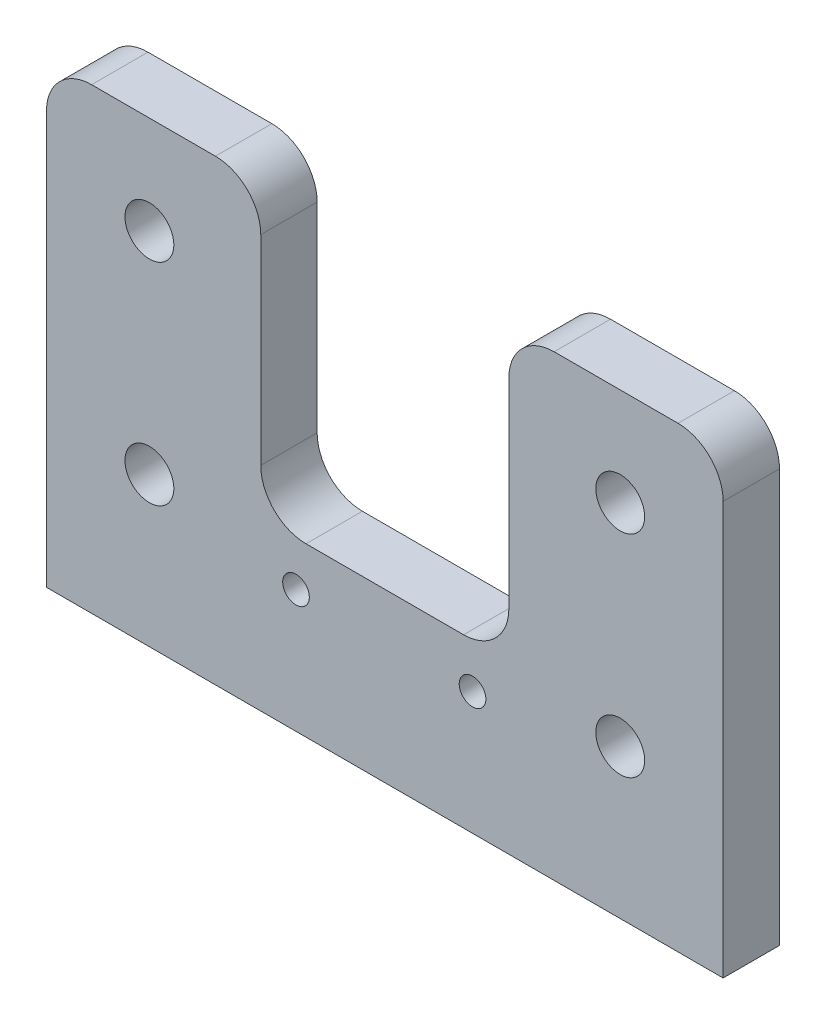
ISO-10303-21;
HEADER;
FILE_DESCRIPTION(('STEP AP214'),'2;1');
FILE_NAME('part.step','',(''),(''),'','','');
FILE_SCHEMA(('AUTOMOTIVE_DESIGN { 1 0 10303 214 1 1 1 1 }'));
ENDSEC;
DATA;
#1=APPLICATION_CONTEXT('core data for automotive mechanical design processes');
#2=APPLICATION_PROTOCOL_DEFINITION('international standard','automotive_design',2000,#1);
#3=PRODUCT_CONTEXT('',#1,'mechanical');
#4=PRODUCT('Part','Part','',(#3));
#5=PRODUCT_RELATED_PRODUCT_CATEGORY('part','',(#4));
#6=PRODUCT_DEFINITION_FORMATION('','',#4);
#7=PRODUCT_DEFINITION_CONTEXT('part definition',#1,'design');
#8=PRODUCT_DEFINITION('design','',#6,#7);
#9=PRODUCT_DEFINITION_SHAPE('','',#8);
#10=(LENGTH_UNIT() NAMED_UNIT(*) SI_UNIT(.MILLI.,.METRE.));
#11=(NAMED_UNIT(*) PLANE_ANGLE_UNIT() SI_UNIT($,.RADIAN.));
#12=(NAMED_UNIT(*) SI_UNIT($,.STERADIAN.) SOLID_ANGLE_UNIT());
#13=UNCERTAINTY_MEASURE_WITH_UNIT(LENGTH_MEASURE(1.E-05),#10,'distance_accuracy_value','');
#14=(GEOMETRIC_REPRESENTATION_CONTEXT(3) GLOBAL_UNCERTAINTY_ASSIGNED_CONTEXT((#13)) GLOBAL_UNIT_ASSIGNED_CONTEXT((#10,
#11,#12)) REPRESENTATION_CONTEXT('',''));
#15=CARTESIAN_POINT('',(0.,0.,0.));
#16=DIRECTION('',(0.,0.,1.));
#17=DIRECTION('',(1.,0.,0.));
#18=AXIS2_PLACEMENT_3D('',#15,#16,#17);
#19=CARTESIAN_POINT('',(0.,51.562,6.35));
#20=DIRECTION('',(0.,-1.,0.));
#21=DIRECTION('',(0.,0.,-1.));
#22=AXIS2_PLACEMENT_3D('',#19,#20,#21);
#23=PLANE('',#22);
#24=DIRECTION('',(-1.,0.,0.));
#25=VECTOR('',#24,1.);
#26=CARTESIAN_POINT('',(0.,51.562,6.35));
#27=LINE('',#26,#25);
#28=CARTESIAN_POINT('',(19.03,51.562,6.35));
#29=VERTEX_POINT('',#28);
#30=CARTESIAN_POINT('',(5.07999999999997,51.562,6.35));
#31=VERTEX_POINT('',#30);
#32=EDGE_CURVE('E324',#29,#31,#27,.T.);
#33=ORIENTED_EDGE('',*,*,#32,.F.);
#34=DIRECTION('',(0.,0.,1.));
#35=VECTOR('',#34,1.);
#36=CARTESIAN_POINT('',(19.03,51.562,0.));
#37=LINE('',#36,#35);
#38=CARTESIAN_POINT('',(19.03,51.562,0.));
#39=VERTEX_POINT('',#38);
#40=EDGE_CURVE('E239',#29,#39,#37,.F.);
#41=ORIENTED_EDGE('',*,*,#40,.T.);
#42=DIRECTION('',(-1.,0.,0.));
#43=VECTOR('',#42,1.);
#44=CARTESIAN_POINT('',(0.,51.562,0.));
#45=LINE('',#44,#43);
#46=CARTESIAN_POINT('',(5.07999999999997,51.562,0.));
#47=VERTEX_POINT('',#46);
#48=EDGE_CURVE('E336',#39,#47,#45,.T.);
#49=ORIENTED_EDGE('',*,*,#48,.T.);
#50=DIRECTION('',(0.,0.,-1.));
#51=VECTOR('',#50,1.);
#52=CARTESIAN_POINT('',(5.07999999999997,51.562,6.35));
#53=LINE('',#52,#51);
#54=EDGE_CURVE('E207',#47,#31,#53,.F.);
#55=ORIENTED_EDGE('',*,*,#54,.T.);
#56=EDGE_LOOP('',(#33,#41,#49,#55));
#57=FACE_BOUND('',#56,.T.);
#58=ADVANCED_FACE('F38',(#57),#23,.F.);
#59=CARTESIAN_POINT('',(0.,0.,6.35));
#60=DIRECTION('',(1.,0.,0.));
#61=DIRECTION('',(0.,1.,0.));
#62=AXIS2_PLACEMENT_3D('',#59,#60,#61);
#63=PLANE('',#62);
#64=DIRECTION('',(0.,-1.,0.));
#65=VECTOR('',#64,1.);
#66=CARTESIAN_POINT('',(0.,0.,6.35));
#67=LINE('',#66,#65);
#68=CARTESIAN_POINT('',(0.,46.482,6.35));
#69=VERTEX_POINT('',#68);
#70=CARTESIAN_POINT('',(0.,0.,6.35));
#71=VERTEX_POINT('',#70);
#72=EDGE_CURVE('E141',#69,#71,#67,.T.);
#73=ORIENTED_EDGE('',*,*,#72,.F.);
#74=DIRECTION('',(0.,0.,-1.));
#75=VECTOR('',#74,1.);
#76=CARTESIAN_POINT('',(0.,46.482,6.35));
#77=LINE('',#76,#75);
#78=CARTESIAN_POINT('',(0.,46.482,0.));
#79=VERTEX_POINT('',#78);
#80=EDGE_CURVE('E204',#69,#79,#77,.T.);
#81=ORIENTED_EDGE('',*,*,#80,.T.);
#82=DIRECTION('',(0.,-1.,0.));
#83=VECTOR('',#82,1.);
#84=CARTESIAN_POINT('',(0.,0.,0.));
#85=LINE('',#84,#83);
#86=CARTESIAN_POINT('',(0.,0.,0.));
#87=VERTEX_POINT('',#86);
#88=EDGE_CURVE('E169',#79,#87,#85,.T.);
#89=ORIENTED_EDGE('',*,*,#88,.T.);
#90=DIRECTION('',(0.,0.,-1.));
#91=VECTOR('',#90,1.);
#92=CARTESIAN_POINT('',(0.,0.,6.35));
#93=LINE('',#92,#91);
#94=EDGE_CURVE('E160',#71,#87,#93,.T.);
#95=ORIENTED_EDGE('',*,*,#94,.F.);
#96=EDGE_LOOP('',(#73,#81,#89,#95));
#97=FACE_BOUND('',#96,.T.);
#98=ADVANCED_FACE('F167',(#97),#63,.F.);
#99=CARTESIAN_POINT('',(0.,0.,6.35));
#100=DIRECTION('',(0.,1.,0.));
#101=DIRECTION('',(0.,0.,1.));
#102=AXIS2_PLACEMENT_3D('',#99,#100,#101);
#103=PLANE('',#102);
#104=DIRECTION('',(1.,0.,0.));
#105=VECTOR('',#104,1.);
#106=CARTESIAN_POINT('',(0.,0.,0.));
#107=LINE('',#106,#105);
#108=CARTESIAN_POINT('',(76.2,0.,0.));
#109=VERTEX_POINT('',#108);
#110=EDGE_CURVE('E330',#87,#109,#107,.T.);
#111=ORIENTED_EDGE('',*,*,#110,.T.);
#112=DIRECTION('',(0.,0.,-1.));
#113=VECTOR('',#112,1.);
#114=CARTESIAN_POINT('',(76.2,0.,6.35));
#115=LINE('',#114,#113);
#116=CARTESIAN_POINT('',(76.2,0.,6.35));
#117=VERTEX_POINT('',#116);
#118=EDGE_CURVE('E162',#117,#109,#115,.T.);
#119=ORIENTED_EDGE('',*,*,#118,.F.);
#120=DIRECTION('',(1.,0.,0.));
#121=VECTOR('',#120,1.);
#122=CARTESIAN_POINT('',(0.,0.,6.35));
#123=LINE('',#122,#121);
#124=EDGE_CURVE('E146',#71,#117,#123,.T.);
#125=ORIENTED_EDGE('',*,*,#124,.F.);
#126=ORIENTED_EDGE('',*,*,#94,.T.);
#127=EDGE_LOOP('',(#111,#119,#125,#126));
#128=FACE_BOUND('',#127,.T.);
#129=ADVANCED_FACE('F159',(#128),#103,.F.);
#130=CARTESIAN_POINT('',(76.2,0.,6.35));
#131=DIRECTION('',(-1.,0.,0.));
#132=DIRECTION('',(0.,-1.,0.));
#133=AXIS2_PLACEMENT_3D('',#130,#131,#132);
#134=PLANE('',#133);
#135=DIRECTION('',(0.,1.,0.));
#136=VECTOR('',#135,1.);
#137=CARTESIAN_POINT('',(76.2,0.,0.));
#138=LINE('',#137,#136);
#139=CARTESIAN_POINT('',(76.2,46.482,0.));
#140=VERTEX_POINT('',#139);
#141=EDGE_CURVE('E333',#109,#140,#138,.T.);
#142=ORIENTED_EDGE('',*,*,#141,.T.);
#143=DIRECTION('',(0.,0.,-1.));
#144=VECTOR('',#143,1.);
#145=CARTESIAN_POINT('',(76.2,46.482,6.35));
#146=LINE('',#145,#144);
#147=CARTESIAN_POINT('',(76.2,46.482,6.35));
#148=VERTEX_POINT('',#147);
#149=EDGE_CURVE('E196',#140,#148,#146,.F.);
#150=ORIENTED_EDGE('',*,*,#149,.T.);
#151=DIRECTION('',(0.,1.,0.));
#152=VECTOR('',#151,1.);
#153=CARTESIAN_POINT('',(76.2,0.,6.35));
#154=LINE('',#153,#152);
#155=EDGE_CURVE('E165',#117,#148,#154,.T.);
#156=ORIENTED_EDGE('',*,*,#155,.F.);
#157=ORIENTED_EDGE('',*,*,#118,.T.);
#158=EDGE_LOOP('',(#142,#150,#156,#157));
#159=FACE_BOUND('',#158,.T.);
#160=ADVANCED_FACE('F376',(#159),#134,.F.);
#161=CARTESIAN_POINT('',(71.12,51.562,0.));
#162=VERTEX_POINT('',#161);
#163=CARTESIAN_POINT('',(57.17,51.562,0.));
#164=VERTEX_POINT('',#163);
#165=EDGE_CURVE('E155',#162,#164,#45,.T.);
#166=ORIENTED_EDGE('',*,*,#165,.T.);
#167=DIRECTION('',(0.,0.,1.));
#168=VECTOR('',#167,1.);
#169=CARTESIAN_POINT('',(57.17,51.562,6.35));
#170=LINE('',#169,#168);
#171=CARTESIAN_POINT('',(57.17,51.562,6.35));
#172=VERTEX_POINT('',#171);
#173=EDGE_CURVE('E254',#164,#172,#170,.T.);
#174=ORIENTED_EDGE('',*,*,#173,.T.);
#175=CARTESIAN_POINT('',(71.12,51.562,6.35));
#176=VERTEX_POINT('',#175);
#177=EDGE_CURVE('E179',#176,#172,#27,.T.);
#178=ORIENTED_EDGE('',*,*,#177,.F.);
#179=DIRECTION('',(0.,0.,-1.));
#180=VECTOR('',#179,1.);
#181=CARTESIAN_POINT('',(71.12,51.562,6.35));
#182=LINE('',#181,#180);
#183=EDGE_CURVE('E185',#176,#162,#182,.T.);
#184=ORIENTED_EDGE('',*,*,#183,.T.);
#185=EDGE_LOOP('',(#166,#174,#178,#184));
#186=FACE_BOUND('',#185,.T.);
#187=ADVANCED_FACE('F368',(#186),#23,.F.);
#188=CARTESIAN_POINT('',(0.,0.,6.35));
#189=DIRECTION('',(0.,0.,-1.));
#190=DIRECTION('',(-1.,0.,0.));
#191=AXIS2_PLACEMENT_3D('',#188,#189,#190);
#192=PLANE('',#191);
#193=CARTESIAN_POINT('',(47.98,13.83,6.35));
#194=DIRECTION('',(0.,0.,1.));
#195=DIRECTION('',(1.,0.,0.));
#196=AXIS2_PLACEMENT_3D('',#193,#194,#195);
#197=CIRCLE('',#196,1.5);
#198=CARTESIAN_POINT('',(49.48,13.83,6.35));
#199=VERTEX_POINT('',#198);
#200=EDGE_CURVE('E275',#199,#199,#197,.T.);
#201=ORIENTED_EDGE('',*,*,#200,.F.);
#202=EDGE_LOOP('',(#201));
#203=FACE_BOUND('',#202,.T.);
#204=CARTESIAN_POINT('',(28.1,13.83,6.35));
#205=DIRECTION('',(0.,0.,1.));
#206=DIRECTION('',(1.,0.,0.));
#207=AXIS2_PLACEMENT_3D('',#204,#205,#206);
#208=CIRCLE('',#207,1.5);
#209=CARTESIAN_POINT('',(29.6,13.83,6.35));
#210=VERTEX_POINT('',#209);
#211=EDGE_CURVE('E283',#210,#210,#208,.T.);
#212=ORIENTED_EDGE('',*,*,#211,.F.);
#213=EDGE_LOOP('',(#212));
#214=FACE_BOUND('',#213,.T.);
#215=CARTESIAN_POINT('',(11.588,40.562,6.35));
#216=DIRECTION('',(0.,0.,-1.));
#217=DIRECTION('',(-1.,0.,0.));
#218=AXIS2_PLACEMENT_3D('',#215,#216,#217);
#219=CIRCLE('',#218,2.75000000000001);
#220=CARTESIAN_POINT('',(8.83799999999995,40.562,6.35));
#221=VERTEX_POINT('',#220);
#222=EDGE_CURVE('E222',#221,#221,#219,.T.);
#223=ORIENTED_EDGE('',*,*,#222,.T.);
#224=EDGE_LOOP('',(#223));
#225=FACE_BOUND('',#224,.T.);
#226=CARTESIAN_POINT('',(64.612,40.562,6.35));
#227=DIRECTION('',(0.,0.,1.));
#228=DIRECTION('',(1.,0.,0.));
#229=AXIS2_PLACEMENT_3D('',#226,#227,#228);
#230=CIRCLE('',#229,2.75000000000001);
#231=CARTESIAN_POINT('',(67.362,40.562,6.35));
#232=VERTEX_POINT('',#231);
#233=EDGE_CURVE('E217',#232,#232,#230,.T.);
#234=ORIENTED_EDGE('',*,*,#233,.F.);
#235=EDGE_LOOP('',(#234));
#236=FACE_BOUND('',#235,.T.);
#237=CARTESIAN_POINT('',(11.588,16.8,6.34999999999999));
#238=DIRECTION('',(0.,0.,-1.));
#239=DIRECTION('',(-1.,0.,0.));
#240=AXIS2_PLACEMENT_3D('',#237,#238,#239);
#241=CIRCLE('',#240,2.75);
#242=CARTESIAN_POINT('',(8.83799999999999,16.8,6.34999999999999));
#243=VERTEX_POINT('',#242);
#244=EDGE_CURVE('E311',#243,#243,#241,.T.);
#245=ORIENTED_EDGE('',*,*,#244,.T.);
#246=EDGE_LOOP('',(#245));
#247=FACE_BOUND('',#246,.T.);
#248=CARTESIAN_POINT('',(64.612,16.8,6.34999999999999));
#249=DIRECTION('',(0.,0.,-1.));
#250=DIRECTION('',(-1.,0.,0.));
#251=AXIS2_PLACEMENT_3D('',#248,#249,#250);
#252=CIRCLE('',#251,2.75);
#253=CARTESIAN_POINT('',(61.862,16.8,6.34999999999999));
#254=VERTEX_POINT('',#253);
#255=EDGE_CURVE('E304',#254,#254,#252,.T.);
#256=ORIENTED_EDGE('',*,*,#255,.T.);
#257=EDGE_LOOP('',(#256));
#258=FACE_BOUND('',#257,.T.);
#259=DIRECTION('',(0.,1.,0.));
#260=VECTOR('',#259,1.);
#261=CARTESIAN_POINT('',(24.13,38.862,6.35));
#262=LINE('',#261,#260);
#263=CARTESIAN_POINT('',(24.13,23.962,6.35));
#264=VERTEX_POINT('',#263);
#265=CARTESIAN_POINT('',(24.13,46.462,6.35));
#266=VERTEX_POINT('',#265);
#267=EDGE_CURVE('E319',#264,#266,#262,.T.);
#268=ORIENTED_EDGE('',*,*,#267,.T.);
#269=CARTESIAN_POINT('',(19.03,46.462,6.35));
#270=DIRECTION('',(0.,0.,-1.));
#271=DIRECTION('',(-1.,0.,0.));
#272=AXIS2_PLACEMENT_3D('',#269,#270,#271);
#273=CIRCLE('',#272,5.1);
#274=EDGE_CURVE('E236',#266,#29,#273,.F.);
#275=ORIENTED_EDGE('',*,*,#274,.T.);
#276=ORIENTED_EDGE('',*,*,#32,.T.);
#277=CARTESIAN_POINT('',(5.07999999999997,46.482,6.35));
#278=DIRECTION('',(0.,0.,-1.));
#279=DIRECTION('',(-1.,0.,0.));
#280=AXIS2_PLACEMENT_3D('',#277,#278,#279);
#281=CIRCLE('',#280,5.08);
#282=EDGE_CURVE('E149',#31,#69,#281,.F.);
#283=ORIENTED_EDGE('',*,*,#282,.T.);
#284=ORIENTED_EDGE('',*,*,#72,.T.);
#285=ORIENTED_EDGE('',*,*,#124,.T.);
#286=ORIENTED_EDGE('',*,*,#155,.T.);
#287=CARTESIAN_POINT('',(71.12,46.482,6.35));
#288=DIRECTION('',(0.,0.,-1.));
#289=DIRECTION('',(-1.,0.,0.));
#290=AXIS2_PLACEMENT_3D('',#287,#288,#289);
#291=CIRCLE('',#290,5.08);
#292=EDGE_CURVE('E201',#148,#176,#291,.F.);
#293=ORIENTED_EDGE('',*,*,#292,.T.);
#294=ORIENTED_EDGE('',*,*,#177,.T.);
#295=CARTESIAN_POINT('',(57.17,46.462,6.35));
#296=DIRECTION('',(0.,0.,-1.));
#297=DIRECTION('',(-1.,0.,0.));
#298=AXIS2_PLACEMENT_3D('',#295,#296,#297);
#299=CIRCLE('',#298,5.1);
#300=CARTESIAN_POINT('',(52.07,46.462,6.35));
#301=VERTEX_POINT('',#300);
#302=EDGE_CURVE('E233',#172,#301,#299,.F.);
#303=ORIENTED_EDGE('',*,*,#302,.T.);
#304=DIRECTION('',(0.,1.,0.));
#305=VECTOR('',#304,1.);
#306=CARTESIAN_POINT('',(52.07,38.862,6.35));
#307=LINE('',#306,#305);
#308=CARTESIAN_POINT('',(52.07,23.962,6.35));
#309=VERTEX_POINT('',#308);
#310=EDGE_CURVE('E315',#309,#301,#307,.T.);
#311=ORIENTED_EDGE('',*,*,#310,.F.);
#312=CARTESIAN_POINT('',(46.97,23.962,6.35));
#313=DIRECTION('',(0.,0.,-1.));
#314=DIRECTION('',(-1.,0.,0.));
#315=AXIS2_PLACEMENT_3D('',#312,#313,#314);
#316=CIRCLE('',#315,5.1);
#317=CARTESIAN_POINT('',(46.97,18.862,6.35));
#318=VERTEX_POINT('',#317);
#319=EDGE_CURVE('E48',#309,#318,#316,.T.);
#320=ORIENTED_EDGE('',*,*,#319,.T.);
#321=DIRECTION('',(1.,0.,0.));
#322=VECTOR('',#321,1.);
#323=CARTESIAN_POINT('',(52.07,18.862,6.35));
#324=LINE('',#323,#322);
#325=CARTESIAN_POINT('',(29.23,18.862,6.35));
#326=VERTEX_POINT('',#325);
#327=EDGE_CURVE('E281',#326,#318,#324,.T.);
#328=ORIENTED_EDGE('',*,*,#327,.F.);
#329=CARTESIAN_POINT('',(29.23,23.962,6.35));
#330=DIRECTION('',(0.,0.,-1.));
#331=DIRECTION('',(-1.,0.,0.));
#332=AXIS2_PLACEMENT_3D('',#329,#330,#331);
#333=CIRCLE('',#332,5.1);
#334=EDGE_CURVE('E265',#326,#264,#333,.T.);
#335=ORIENTED_EDGE('',*,*,#334,.T.);
#336=EDGE_LOOP('',(#268,#275,#276,#283,#284,#285,#286,#293,#294,#303,#311,#320,#328,#335));
#337=FACE_BOUND('',#336,.T.);
#338=ADVANCED_FACE('F144',(#203,#214,#225,#236,#247,#258,#337),#192,.F.);
#339=CARTESIAN_POINT('',(0.,0.,0.));
#340=DIRECTION('',(0.,0.,-1.));
#341=DIRECTION('',(-1.,0.,0.));
#342=AXIS2_PLACEMENT_3D('',#339,#340,#341);
#343=PLANE('',#342);
#344=CARTESIAN_POINT('',(47.98,13.83,0.));
#345=DIRECTION('',(0.,0.,-1.));
#346=DIRECTION('',(-1.,0.,0.));
#347=AXIS2_PLACEMENT_3D('',#344,#345,#346);
#348=CIRCLE('',#347,1.5);
#349=CARTESIAN_POINT('',(46.48,13.83,0.));
#350=VERTEX_POINT('',#349);
#351=EDGE_CURVE('E42',#350,#350,#348,.T.);
#352=ORIENTED_EDGE('',*,*,#351,.F.);
#353=EDGE_LOOP('',(#352));
#354=FACE_BOUND('',#353,.T.);
#355=CARTESIAN_POINT('',(28.1,13.83,0.));
#356=DIRECTION('',(0.,0.,-1.));
#357=DIRECTION('',(-1.,0.,0.));
#358=AXIS2_PLACEMENT_3D('',#355,#356,#357);
#359=CIRCLE('',#358,1.5);
#360=CARTESIAN_POINT('',(26.6,13.83,0.));
#361=VERTEX_POINT('',#360);
#362=EDGE_CURVE('E272',#361,#361,#359,.T.);
#363=ORIENTED_EDGE('',*,*,#362,.F.);
#364=EDGE_LOOP('',(#363));
#365=FACE_BOUND('',#364,.T.);
#366=ORIENTED_EDGE('',*,*,#48,.F.);
#367=CARTESIAN_POINT('',(19.03,46.462,0.));
#368=DIRECTION('',(0.,0.,-1.));
#369=DIRECTION('',(-1.,0.,0.));
#370=AXIS2_PLACEMENT_3D('',#367,#368,#369);
#371=CIRCLE('',#370,5.1);
#372=CARTESIAN_POINT('',(24.13,46.462,0.));
#373=VERTEX_POINT('',#372);
#374=EDGE_CURVE('E244',#39,#373,#371,.T.);
#375=ORIENTED_EDGE('',*,*,#374,.T.);
#376=DIRECTION('',(0.,-1.,0.));
#377=VECTOR('',#376,1.);
#378=CARTESIAN_POINT('',(24.13,0.,0.));
#379=LINE('',#378,#377);
#380=CARTESIAN_POINT('',(24.13,23.962,0.));
#381=VERTEX_POINT('',#380);
#382=EDGE_CURVE('E172',#373,#381,#379,.T.);
#383=ORIENTED_EDGE('',*,*,#382,.T.);
#384=CARTESIAN_POINT('',(29.23,23.962,0.));
#385=DIRECTION('',(0.,0.,-1.));
#386=DIRECTION('',(-1.,0.,0.));
#387=AXIS2_PLACEMENT_3D('',#384,#385,#386);
#388=CIRCLE('',#387,5.1);
#389=CARTESIAN_POINT('',(29.23,18.862,0.));
#390=VERTEX_POINT('',#389);
#391=EDGE_CURVE('E268',#381,#390,#388,.F.);
#392=ORIENTED_EDGE('',*,*,#391,.T.);
#393=DIRECTION('',(-1.,0.,0.));
#394=VECTOR('',#393,1.);
#395=CARTESIAN_POINT('',(0.,18.862,0.));
#396=LINE('',#395,#394);
#397=CARTESIAN_POINT('',(46.97,18.862,0.));
#398=VERTEX_POINT('',#397);
#399=EDGE_CURVE('E211',#398,#390,#396,.T.);
#400=ORIENTED_EDGE('',*,*,#399,.F.);
#401=CARTESIAN_POINT('',(46.97,23.962,0.));
#402=DIRECTION('',(0.,0.,-1.));
#403=DIRECTION('',(-1.,0.,0.));
#404=AXIS2_PLACEMENT_3D('',#401,#402,#403);
#405=CIRCLE('',#404,5.1);
#406=CARTESIAN_POINT('',(52.07,23.962,0.));
#407=VERTEX_POINT('',#406);
#408=EDGE_CURVE('E11',#398,#407,#405,.F.);
#409=ORIENTED_EDGE('',*,*,#408,.T.);
#410=DIRECTION('',(0.,-1.,0.));
#411=VECTOR('',#410,1.);
#412=CARTESIAN_POINT('',(52.07,0.,0.));
#413=LINE('',#412,#411);
#414=CARTESIAN_POINT('',(52.07,46.462,0.));
#415=VERTEX_POINT('',#414);
#416=EDGE_CURVE('E177',#415,#407,#413,.T.);
#417=ORIENTED_EDGE('',*,*,#416,.F.);
#418=CARTESIAN_POINT('',(57.17,46.462,0.));
#419=DIRECTION('',(0.,0.,-1.));
#420=DIRECTION('',(-1.,0.,0.));
#421=AXIS2_PLACEMENT_3D('',#418,#419,#420);
#422=CIRCLE('',#421,5.1);
#423=EDGE_CURVE('E56',#415,#164,#422,.T.);
#424=ORIENTED_EDGE('',*,*,#423,.T.);
#425=ORIENTED_EDGE('',*,*,#165,.F.);
#426=CARTESIAN_POINT('',(71.12,46.482,0.));
#427=DIRECTION('',(0.,0.,-1.));
#428=DIRECTION('',(-1.,0.,0.));
#429=AXIS2_PLACEMENT_3D('',#426,#427,#428);
#430=CIRCLE('',#429,5.08);
#431=EDGE_CURVE('E193',#162,#140,#430,.T.);
#432=ORIENTED_EDGE('',*,*,#431,.T.);
#433=ORIENTED_EDGE('',*,*,#141,.F.);
#434=ORIENTED_EDGE('',*,*,#110,.F.);
#435=ORIENTED_EDGE('',*,*,#88,.F.);
#436=CARTESIAN_POINT('',(5.07999999999997,46.482,0.));
#437=DIRECTION('',(0.,0.,-1.));
#438=DIRECTION('',(-1.,0.,0.));
#439=AXIS2_PLACEMENT_3D('',#436,#437,#438);
#440=CIRCLE('',#439,5.08);
#441=EDGE_CURVE('E189',#79,#47,#440,.T.);
#442=ORIENTED_EDGE('',*,*,#441,.T.);
#443=EDGE_LOOP('',(#366,#375,#383,#392,#400,#409,#417,#424,#425,#432,#433,#434,#435,#442));
#444=FACE_BOUND('',#443,.T.);
#445=CARTESIAN_POINT('',(11.588,40.562,0.));
#446=DIRECTION('',(0.,0.,-1.));
#447=DIRECTION('',(-1.,0.,0.));
#448=AXIS2_PLACEMENT_3D('',#445,#446,#447);
#449=CIRCLE('',#448,2.75000000000001);
#450=CARTESIAN_POINT('',(8.83799999999995,40.562,0.));
#451=VERTEX_POINT('',#450);
#452=EDGE_CURVE('E218',#451,#451,#449,.F.);
#453=ORIENTED_EDGE('',*,*,#452,.T.);
#454=EDGE_LOOP('',(#453));
#455=FACE_BOUND('',#454,.T.);
#456=CARTESIAN_POINT('',(64.612,40.562,0.));
#457=DIRECTION('',(0.,0.,-1.));
#458=DIRECTION('',(-1.,0.,0.));
#459=AXIS2_PLACEMENT_3D('',#456,#457,#458);
#460=CIRCLE('',#459,2.75000000000001);
#461=CARTESIAN_POINT('',(61.862,40.562,0.));
#462=VERTEX_POINT('',#461);
#463=EDGE_CURVE('E212',#462,#462,#460,.T.);
#464=ORIENTED_EDGE('',*,*,#463,.F.);
#465=EDGE_LOOP('',(#464));
#466=FACE_BOUND('',#465,.T.);
#467=CARTESIAN_POINT('',(11.588,16.8,0.));
#468=DIRECTION('',(0.,0.,-1.));
#469=DIRECTION('',(-1.,0.,0.));
#470=AXIS2_PLACEMENT_3D('',#467,#468,#469);
#471=CIRCLE('',#470,2.75);
#472=CARTESIAN_POINT('',(8.83799999999999,16.8,0.));
#473=VERTEX_POINT('',#472);
#474=EDGE_CURVE('E300',#473,#473,#471,.T.);
#475=ORIENTED_EDGE('',*,*,#474,.F.);
#476=EDGE_LOOP('',(#475));
#477=FACE_BOUND('',#476,.T.);
#478=CARTESIAN_POINT('',(64.612,16.8,0.));
#479=DIRECTION('',(0.,0.,-1.));
#480=DIRECTION('',(-1.,0.,0.));
#481=AXIS2_PLACEMENT_3D('',#478,#479,#480);
#482=CIRCLE('',#481,2.75);
#483=CARTESIAN_POINT('',(61.862,16.8,0.));
#484=VERTEX_POINT('',#483);
#485=EDGE_CURVE('E216',#484,#484,#482,.T.);
#486=ORIENTED_EDGE('',*,*,#485,.F.);
#487=EDGE_LOOP('',(#486));
#488=FACE_BOUND('',#487,.T.);
#489=ADVANCED_FACE('F347',(#354,#365,#444,#455,#466,#477,#488),#343,.T.);
#490=CARTESIAN_POINT('',(52.07,38.862,-3.556));
#491=DIRECTION('',(1.,0.,0.));
#492=DIRECTION('',(0.,1.,0.));
#493=AXIS2_PLACEMENT_3D('',#490,#491,#492);
#494=PLANE('',#493);
#495=ORIENTED_EDGE('',*,*,#310,.T.);
#496=DIRECTION('',(0.,0.,1.));
#497=VECTOR('',#496,1.);
#498=CARTESIAN_POINT('',(52.07,46.462,-3.556));
#499=LINE('',#498,#497);
#500=EDGE_CURVE('E262',#301,#415,#499,.F.);
#501=ORIENTED_EDGE('',*,*,#500,.T.);
#502=ORIENTED_EDGE('',*,*,#416,.T.);
#503=DIRECTION('',(0.,0.,1.));
#504=VECTOR('',#503,1.);
#505=CARTESIAN_POINT('',(52.07,23.962,6.35));
#506=LINE('',#505,#504);
#507=EDGE_CURVE('E258',#407,#309,#506,.T.);
#508=ORIENTED_EDGE('',*,*,#507,.T.);
#509=EDGE_LOOP('',(#495,#501,#502,#508));
#510=FACE_BOUND('',#509,.T.);
#511=ADVANCED_FACE('F399',(#510),#494,.F.);
#512=CARTESIAN_POINT('',(24.13,38.862,-3.556));
#513=DIRECTION('',(1.,0.,0.));
#514=DIRECTION('',(0.,0.,-1.));
#515=AXIS2_PLACEMENT_3D('',#512,#513,#514);
#516=PLANE('',#515);
#517=ORIENTED_EDGE('',*,*,#382,.F.);
#518=DIRECTION('',(0.,0.,1.));
#519=VECTOR('',#518,1.);
#520=CARTESIAN_POINT('',(24.13,46.462,6.35));
#521=LINE('',#520,#519);
#522=EDGE_CURVE('E229',#373,#266,#521,.T.);
#523=ORIENTED_EDGE('',*,*,#522,.T.);
#524=ORIENTED_EDGE('',*,*,#267,.F.);
#525=DIRECTION('',(0.,0.,1.));
#526=VECTOR('',#525,1.);
#527=CARTESIAN_POINT('',(24.13,23.962,-3.556));
#528=LINE('',#527,#526);
#529=EDGE_CURVE('E226',#264,#381,#528,.F.);
#530=ORIENTED_EDGE('',*,*,#529,.T.);
#531=EDGE_LOOP('',(#517,#523,#524,#530));
#532=FACE_BOUND('',#531,.T.);
#533=ADVANCED_FACE('F362',(#532),#516,.T.);
#534=CARTESIAN_POINT('',(71.12,46.482,6.35));
#535=DIRECTION('',(0.,0.,-1.));
#536=DIRECTION('',(-1.,0.,0.));
#537=AXIS2_PLACEMENT_3D('',#534,#535,#536);
#538=CYLINDRICAL_SURFACE('',#537,5.08);
#539=ORIENTED_EDGE('',*,*,#292,.F.);
#540=ORIENTED_EDGE('',*,*,#149,.F.);
#541=ORIENTED_EDGE('',*,*,#431,.F.);
#542=ORIENTED_EDGE('',*,*,#183,.F.);
#543=EDGE_LOOP('',(#539,#540,#541,#542));
#544=FACE_BOUND('',#543,.T.);
#545=ADVANCED_FACE('F353',(#544),#538,.T.);
#546=CARTESIAN_POINT('',(5.07999999999997,46.482,6.35));
#547=DIRECTION('',(0.,0.,-1.));
#548=DIRECTION('',(-1.,0.,0.));
#549=AXIS2_PLACEMENT_3D('',#546,#547,#548);
#550=CYLINDRICAL_SURFACE('',#549,5.08);
#551=ORIENTED_EDGE('',*,*,#282,.F.);
#552=ORIENTED_EDGE('',*,*,#54,.F.);
#553=ORIENTED_EDGE('',*,*,#441,.F.);
#554=ORIENTED_EDGE('',*,*,#80,.F.);
#555=EDGE_LOOP('',(#551,#552,#553,#554));
#556=FACE_BOUND('',#555,.T.);
#557=ADVANCED_FACE('F350',(#556),#550,.T.);
#558=CARTESIAN_POINT('',(64.612,16.8,127.));
#559=DIRECTION('',(0.,0.,-1.));
#560=DIRECTION('',(-1.,0.,0.));
#561=AXIS2_PLACEMENT_3D('',#558,#559,#560);
#562=CYLINDRICAL_SURFACE('',#561,2.75);
#563=ORIENTED_EDGE('',*,*,#485,.T.);
#564=EDGE_LOOP('',(#563));
#565=FACE_BOUND('',#564,.T.);
#566=ORIENTED_EDGE('',*,*,#255,.F.);
#567=EDGE_LOOP('',(#566));
#568=FACE_BOUND('',#567,.T.);
#569=ADVANCED_FACE('F352',(#565,#568),#562,.F.);
#570=CARTESIAN_POINT('',(11.588,16.8,127.));
#571=DIRECTION('',(0.,0.,-1.));
#572=DIRECTION('',(-1.,0.,0.));
#573=AXIS2_PLACEMENT_3D('',#570,#571,#572);
#574=CYLINDRICAL_SURFACE('',#573,2.75);
#575=ORIENTED_EDGE('',*,*,#474,.T.);
#576=EDGE_LOOP('',(#575));
#577=FACE_BOUND('',#576,.T.);
#578=ORIENTED_EDGE('',*,*,#244,.F.);
#579=EDGE_LOOP('',(#578));
#580=FACE_BOUND('',#579,.T.);
#581=ADVANCED_FACE('F359',(#577,#580),#574,.F.);
#582=CARTESIAN_POINT('',(64.612,40.562,-26.066));
#583=DIRECTION('',(0.,0.,1.));
#584=DIRECTION('',(1.,0.,0.));
#585=AXIS2_PLACEMENT_3D('',#582,#583,#584);
#586=CYLINDRICAL_SURFACE('',#585,2.75000000000001);
#587=ORIENTED_EDGE('',*,*,#463,.T.);
#588=EDGE_LOOP('',(#587));
#589=FACE_BOUND('',#588,.T.);
#590=ORIENTED_EDGE('',*,*,#233,.T.);
#591=EDGE_LOOP('',(#590));
#592=FACE_BOUND('',#591,.T.);
#593=ADVANCED_FACE('F445',(#589,#592),#586,.F.);
#594=CARTESIAN_POINT('',(11.588,40.562,-26.066));
#595=DIRECTION('',(0.,0.,1.));
#596=DIRECTION('',(1.,0.,0.));
#597=AXIS2_PLACEMENT_3D('',#594,#595,#596);
#598=CYLINDRICAL_SURFACE('',#597,2.75000000000001);
#599=ORIENTED_EDGE('',*,*,#452,.F.);
#600=EDGE_LOOP('',(#599));
#601=FACE_BOUND('',#600,.T.);
#602=ORIENTED_EDGE('',*,*,#222,.F.);
#603=EDGE_LOOP('',(#602));
#604=FACE_BOUND('',#603,.T.);
#605=ADVANCED_FACE('F424',(#601,#604),#598,.F.);
#606=CARTESIAN_POINT('',(52.07,18.862,-12.35));
#607=DIRECTION('',(0.,-1.,0.));
#608=DIRECTION('',(1.,0.,0.));
#609=AXIS2_PLACEMENT_3D('',#606,#607,#608);
#610=PLANE('',#609);
#611=ORIENTED_EDGE('',*,*,#399,.T.);
#612=DIRECTION('',(0.,0.,1.));
#613=VECTOR('',#612,1.);
#614=CARTESIAN_POINT('',(29.23,18.862,-12.35));
#615=LINE('',#614,#613);
#616=EDGE_CURVE('E250',#390,#326,#615,.T.);
#617=ORIENTED_EDGE('',*,*,#616,.T.);
#618=ORIENTED_EDGE('',*,*,#327,.T.);
#619=DIRECTION('',(0.,0.,1.));
#620=VECTOR('',#619,1.);
#621=CARTESIAN_POINT('',(46.97,18.862,0.));
#622=LINE('',#621,#620);
#623=EDGE_CURVE('E247',#318,#398,#622,.F.);
#624=ORIENTED_EDGE('',*,*,#623,.T.);
#625=EDGE_LOOP('',(#611,#617,#618,#624));
#626=FACE_BOUND('',#625,.T.);
#627=ADVANCED_FACE('F405',(#626),#610,.F.);
#628=CARTESIAN_POINT('',(19.03,46.462,-3.556));
#629=DIRECTION('',(0.,0.,-1.));
#630=DIRECTION('',(-1.,0.,0.));
#631=AXIS2_PLACEMENT_3D('',#628,#629,#630);
#632=CYLINDRICAL_SURFACE('',#631,5.1);
#633=ORIENTED_EDGE('',*,*,#374,.F.);
#634=ORIENTED_EDGE('',*,*,#40,.F.);
#635=ORIENTED_EDGE('',*,*,#274,.F.);
#636=ORIENTED_EDGE('',*,*,#522,.F.);
#637=EDGE_LOOP('',(#633,#634,#635,#636));
#638=FACE_BOUND('',#637,.T.);
#639=ADVANCED_FACE('F416',(#638),#632,.T.);
#640=CARTESIAN_POINT('',(29.23,23.962,-12.35));
#641=DIRECTION('',(0.,0.,1.));
#642=DIRECTION('',(1.,0.,0.));
#643=AXIS2_PLACEMENT_3D('',#640,#641,#642);
#644=CYLINDRICAL_SURFACE('',#643,5.1);
#645=ORIENTED_EDGE('',*,*,#391,.F.);
#646=ORIENTED_EDGE('',*,*,#529,.F.);
#647=ORIENTED_EDGE('',*,*,#334,.F.);
#648=ORIENTED_EDGE('',*,*,#616,.F.);
#649=EDGE_LOOP('',(#645,#646,#647,#648));
#650=FACE_BOUND('',#649,.T.);
#651=ADVANCED_FACE('F409',(#650),#644,.F.);
#652=CARTESIAN_POINT('',(57.17,46.462,6.35));
#653=DIRECTION('',(0.,0.,1.));
#654=DIRECTION('',(1.,0.,0.));
#655=AXIS2_PLACEMENT_3D('',#652,#653,#654);
#656=CYLINDRICAL_SURFACE('',#655,5.1);
#657=ORIENTED_EDGE('',*,*,#423,.F.);
#658=ORIENTED_EDGE('',*,*,#500,.F.);
#659=ORIENTED_EDGE('',*,*,#302,.F.);
#660=ORIENTED_EDGE('',*,*,#173,.F.);
#661=EDGE_LOOP('',(#657,#658,#659,#660));
#662=FACE_BOUND('',#661,.T.);
#663=ADVANCED_FACE('F395',(#662),#656,.T.);
#664=CARTESIAN_POINT('',(46.97,23.962,-3.556));
#665=DIRECTION('',(0.,0.,-1.));
#666=DIRECTION('',(-1.,0.,0.));
#667=AXIS2_PLACEMENT_3D('',#664,#665,#666);
#668=CYLINDRICAL_SURFACE('',#667,5.1);
#669=ORIENTED_EDGE('',*,*,#408,.F.);
#670=ORIENTED_EDGE('',*,*,#623,.F.);
#671=ORIENTED_EDGE('',*,*,#319,.F.);
#672=ORIENTED_EDGE('',*,*,#507,.F.);
#673=EDGE_LOOP('',(#669,#670,#671,#672));
#674=FACE_BOUND('',#673,.T.);
#675=ADVANCED_FACE('F40',(#674),#668,.F.);
#676=CARTESIAN_POINT('',(28.1,13.83,-3.65));
#677=DIRECTION('',(0.,0.,1.));
#678=DIRECTION('',(1.,0.,0.));
#679=AXIS2_PLACEMENT_3D('',#676,#677,#678);
#680=CYLINDRICAL_SURFACE('',#679,1.5);
#681=ORIENTED_EDGE('',*,*,#362,.T.);
#682=EDGE_LOOP('',(#681));
#683=FACE_BOUND('',#682,.T.);
#684=ORIENTED_EDGE('',*,*,#211,.T.);
#685=EDGE_LOOP('',(#684));
#686=FACE_BOUND('',#685,.T.);
#687=ADVANCED_FACE('F430',(#683,#686),#680,.F.);
#688=CARTESIAN_POINT('',(47.98,13.83,-3.65));
#689=DIRECTION('',(0.,0.,1.));
#690=DIRECTION('',(1.,0.,0.));
#691=AXIS2_PLACEMENT_3D('',#688,#689,#690);
#692=CYLINDRICAL_SURFACE('',#691,1.5);
#693=ORIENTED_EDGE('',*,*,#351,.T.);
#694=EDGE_LOOP('',(#693));
#695=FACE_BOUND('',#694,.T.);
#696=ORIENTED_EDGE('',*,*,#200,.T.);
#697=EDGE_LOOP('',(#696));
#698=FACE_BOUND('',#697,.T.);
#699=ADVANCED_FACE('F434',(#695,#698),#692,.F.);
#700=CLOSED_SHELL('',(#58,#98,#129,#160,#187,#338,#489,#511,#533,#545,#557,#569,#581,#593,#605,
#627,#639,#651,#663,#675,#687,#699));
#701=MANIFOLD_SOLID_BREP('B2',#700);
#702=ADVANCED_BREP_SHAPE_REPRESENTATION('',(#18,#701),#14);
#703=SHAPE_DEFINITION_REPRESENTATION(#9,#702);
ENDSEC;
END-ISO-10303-21;
